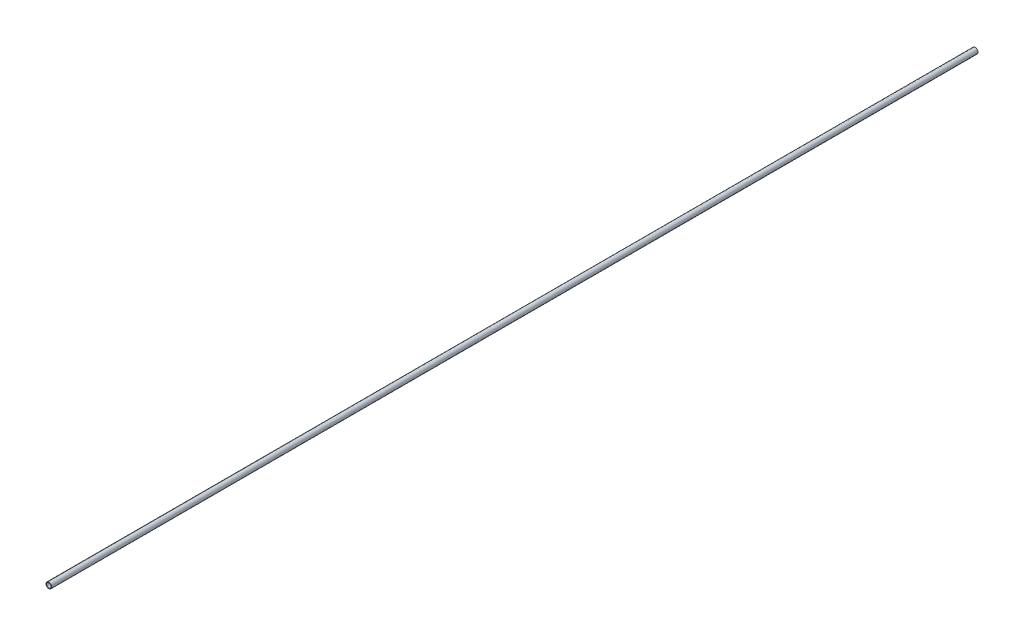
ISO-10303-21;
HEADER;
FILE_DESCRIPTION(('STEP AP214'),'2;1');
FILE_NAME('part.step','',(''),(''),'','','');
FILE_SCHEMA(('AUTOMOTIVE_DESIGN { 1 0 10303 214 1 1 1 1 }'));
ENDSEC;
DATA;
#1=APPLICATION_CONTEXT('core data for automotive mechanical design processes');
#2=APPLICATION_PROTOCOL_DEFINITION('international standard','automotive_design',2000,#1);
#3=PRODUCT_CONTEXT('',#1,'mechanical');
#4=PRODUCT('Part','Part','',(#3));
#5=PRODUCT_RELATED_PRODUCT_CATEGORY('part','',(#4));
#6=PRODUCT_DEFINITION_FORMATION('','',#4);
#7=PRODUCT_DEFINITION_CONTEXT('part definition',#1,'design');
#8=PRODUCT_DEFINITION('design','',#6,#7);
#9=PRODUCT_DEFINITION_SHAPE('','',#8);
#10=(LENGTH_UNIT() NAMED_UNIT(*) SI_UNIT(.MILLI.,.METRE.));
#11=(NAMED_UNIT(*) PLANE_ANGLE_UNIT() SI_UNIT($,.RADIAN.));
#12=(NAMED_UNIT(*) SI_UNIT($,.STERADIAN.) SOLID_ANGLE_UNIT());
#13=UNCERTAINTY_MEASURE_WITH_UNIT(LENGTH_MEASURE(1.E-05),#10,'distance_accuracy_value','');
#14=(GEOMETRIC_REPRESENTATION_CONTEXT(3) GLOBAL_UNCERTAINTY_ASSIGNED_CONTEXT((#13)) GLOBAL_UNIT_ASSIGNED_CONTEXT((#10,
#11,#12)) REPRESENTATION_CONTEXT('',''));
#15=CARTESIAN_POINT('',(0.,0.,0.));
#16=DIRECTION('',(0.,0.,1.));
#17=DIRECTION('',(1.,0.,0.));
#18=AXIS2_PLACEMENT_3D('',#15,#16,#17);
#19=CARTESIAN_POINT('',(0.,0.,5486.4));
#20=DIRECTION('',(0.,0.,1.));
#21=DIRECTION('',(1.,0.,0.));
#22=AXIS2_PLACEMENT_3D('',#19,#20,#21);
#23=PLANE('',#22);
#24=CARTESIAN_POINT('',(0.,0.,5486.4));
#25=DIRECTION('',(0.,0.,1.));
#26=DIRECTION('',(1.,0.,0.));
#27=AXIS2_PLACEMENT_3D('',#24,#25,#26);
#28=CIRCLE('',#27,16.764);
#29=CARTESIAN_POINT('',(16.764,0.,5486.4));
#30=VERTEX_POINT('',#29);
#31=EDGE_CURVE('E10',#30,#30,#28,.T.);
#32=ORIENTED_EDGE('',*,*,#31,.T.);
#33=EDGE_LOOP('',(#32));
#34=FACE_BOUND('',#33,.T.);
#35=CARTESIAN_POINT('',(0.,0.,5486.4));
#36=DIRECTION('',(0.,0.,1.));
#37=DIRECTION('',(1.,0.,0.));
#38=AXIS2_PLACEMENT_3D('',#35,#36,#37);
#39=CIRCLE('',#38,13.3858);
#40=CARTESIAN_POINT('',(13.3858,0.,5486.4));
#41=VERTEX_POINT('',#40);
#42=EDGE_CURVE('E41',#41,#41,#39,.T.);
#43=ORIENTED_EDGE('',*,*,#42,.F.);
#44=EDGE_LOOP('',(#43));
#45=FACE_BOUND('',#44,.T.);
#46=ADVANCED_FACE('F30',(#34,#45),#23,.T.);
#47=CARTESIAN_POINT('',(0.,0.,0.));
#48=DIRECTION('',(0.,0.,1.));
#49=DIRECTION('',(1.,0.,0.));
#50=AXIS2_PLACEMENT_3D('',#47,#48,#49);
#51=PLANE('',#50);
#52=CARTESIAN_POINT('',(0.,0.,0.));
#53=DIRECTION('',(0.,0.,1.));
#54=DIRECTION('',(1.,0.,0.));
#55=AXIS2_PLACEMENT_3D('',#52,#53,#54);
#56=CIRCLE('',#55,16.764);
#57=CARTESIAN_POINT('',(16.764,0.,0.));
#58=VERTEX_POINT('',#57);
#59=EDGE_CURVE('E34',#58,#58,#56,.T.);
#60=ORIENTED_EDGE('',*,*,#59,.F.);
#61=EDGE_LOOP('',(#60));
#62=FACE_BOUND('',#61,.T.);
#63=CARTESIAN_POINT('',(0.,0.,0.));
#64=DIRECTION('',(0.,0.,1.));
#65=DIRECTION('',(1.,0.,0.));
#66=AXIS2_PLACEMENT_3D('',#63,#64,#65);
#67=CIRCLE('',#66,13.3858);
#68=CARTESIAN_POINT('',(13.3858,0.,0.));
#69=VERTEX_POINT('',#68);
#70=EDGE_CURVE('E43',#69,#69,#67,.T.);
#71=ORIENTED_EDGE('',*,*,#70,.T.);
#72=EDGE_LOOP('',(#71));
#73=FACE_BOUND('',#72,.T.);
#74=ADVANCED_FACE('F53',(#62,#73),#51,.F.);
#75=CARTESIAN_POINT('',(0.,0.,5486.4));
#76=DIRECTION('',(0.,0.,-1.));
#77=DIRECTION('',(-1.,0.,0.));
#78=AXIS2_PLACEMENT_3D('',#75,#76,#77);
#79=CYLINDRICAL_SURFACE('',#78,16.764);
#80=ORIENTED_EDGE('',*,*,#31,.F.);
#81=EDGE_LOOP('',(#80));
#82=FACE_BOUND('',#81,.T.);
#83=ORIENTED_EDGE('',*,*,#59,.T.);
#84=EDGE_LOOP('',(#83));
#85=FACE_BOUND('',#84,.T.);
#86=ADVANCED_FACE('F32',(#82,#85),#79,.T.);
#87=CARTESIAN_POINT('',(0.,0.,5486.4));
#88=DIRECTION('',(0.,0.,-1.));
#89=DIRECTION('',(-1.,0.,0.));
#90=AXIS2_PLACEMENT_3D('',#87,#88,#89);
#91=CYLINDRICAL_SURFACE('',#90,13.3858);
#92=ORIENTED_EDGE('',*,*,#42,.T.);
#93=EDGE_LOOP('',(#92));
#94=FACE_BOUND('',#93,.T.);
#95=ORIENTED_EDGE('',*,*,#70,.F.);
#96=EDGE_LOOP('',(#95));
#97=FACE_BOUND('',#96,.T.);
#98=ADVANCED_FACE('F49',(#94,#97),#91,.F.);
#99=CLOSED_SHELL('',(#46,#74,#86,#98));
#100=MANIFOLD_SOLID_BREP('B2',#99);
#101=ADVANCED_BREP_SHAPE_REPRESENTATION('',(#18,#100),#14);
#102=SHAPE_DEFINITION_REPRESENTATION(#9,#101);
ENDSEC;
END-ISO-10303-21;
